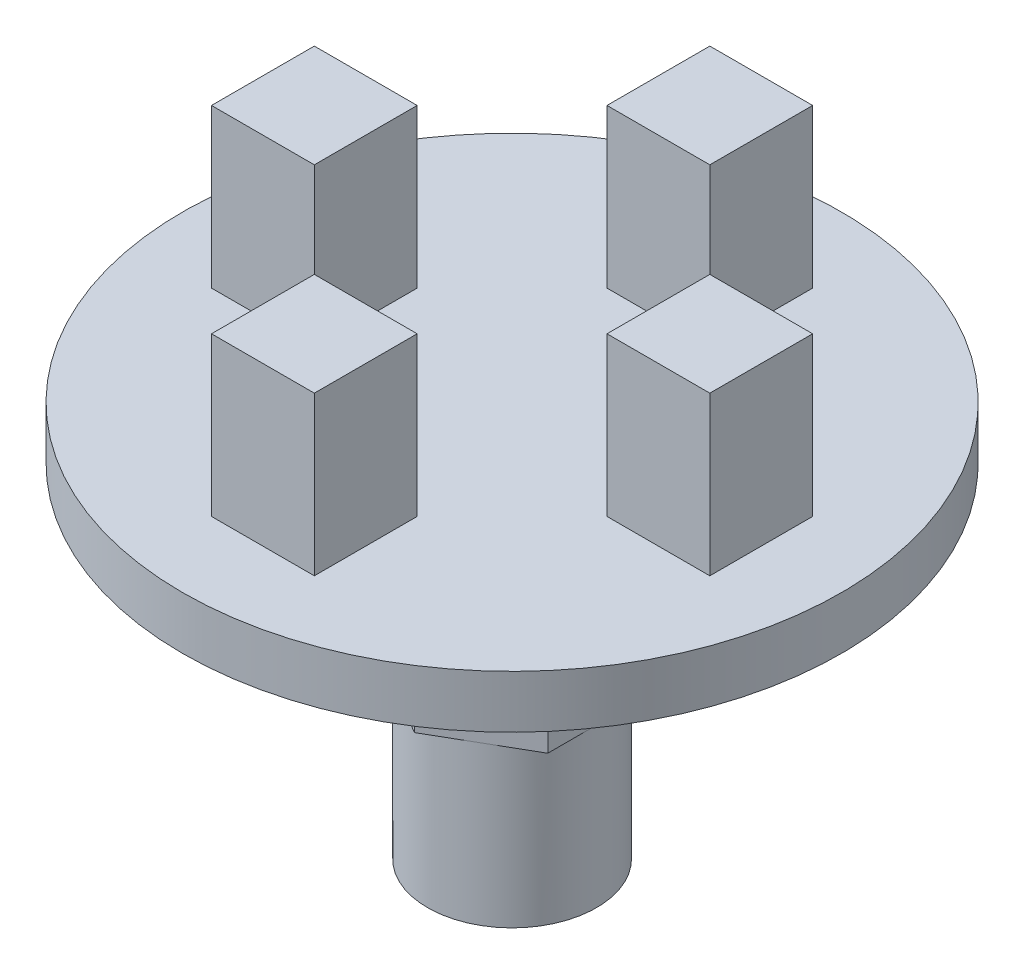
ISO-10303-21;
HEADER;
FILE_DESCRIPTION(('STEP AP214'),'2;1');
FILE_NAME('part.step','',(''),(''),'','','');
FILE_SCHEMA(('AUTOMOTIVE_DESIGN { 1 0 10303 214 1 1 1 1 }'));
ENDSEC;
DATA;
#1=APPLICATION_CONTEXT('core data for automotive mechanical design processes');
#2=APPLICATION_PROTOCOL_DEFINITION('international standard','automotive_design',2000,#1);
#3=PRODUCT_CONTEXT('',#1,'mechanical');
#4=PRODUCT('Part','Part','',(#3));
#5=PRODUCT_RELATED_PRODUCT_CATEGORY('part','',(#4));
#6=PRODUCT_DEFINITION_FORMATION('','',#4);
#7=PRODUCT_DEFINITION_CONTEXT('part definition',#1,'design');
#8=PRODUCT_DEFINITION('design','',#6,#7);
#9=PRODUCT_DEFINITION_SHAPE('','',#8);
#10=(LENGTH_UNIT() NAMED_UNIT(*) SI_UNIT(.MILLI.,.METRE.));
#11=(NAMED_UNIT(*) PLANE_ANGLE_UNIT() SI_UNIT($,.RADIAN.));
#12=(NAMED_UNIT(*) SI_UNIT($,.STERADIAN.) SOLID_ANGLE_UNIT());
#13=UNCERTAINTY_MEASURE_WITH_UNIT(LENGTH_MEASURE(1.E-05),#10,'distance_accuracy_value','');
#14=(GEOMETRIC_REPRESENTATION_CONTEXT(3) GLOBAL_UNCERTAINTY_ASSIGNED_CONTEXT((#13)) GLOBAL_UNIT_ASSIGNED_CONTEXT((#10,
#11,#12)) REPRESENTATION_CONTEXT('',''));
#15=CARTESIAN_POINT('',(0.,0.,0.));
#16=DIRECTION('',(0.,0.,1.));
#17=DIRECTION('',(1.,0.,0.));
#18=AXIS2_PLACEMENT_3D('',#15,#16,#17);
#19=CARTESIAN_POINT('',(0.,-8.,0.));
#20=DIRECTION('',(0.,-1.,0.));
#21=DIRECTION('',(0.,0.,-1.));
#22=AXIS2_PLACEMENT_3D('',#19,#20,#21);
#23=PLANE('',#22);
#24=CARTESIAN_POINT('',(0.,-8.,0.));
#25=DIRECTION('',(0.,-1.,0.));
#26=DIRECTION('',(0.,0.,-1.));
#27=AXIS2_PLACEMENT_3D('',#24,#25,#26);
#28=CIRCLE('',#27,3.20429399400242);
#29=CARTESIAN_POINT('',(1.60214699700121,-8.,-2.775));
#30=VERTEX_POINT('',#29);
#31=CARTESIAN_POINT('',(3.20429399400242,-8.,0.));
#32=VERTEX_POINT('',#31);
#33=EDGE_CURVE('E51',#30,#32,#28,.T.);
#34=ORIENTED_EDGE('',*,*,#33,.F.);
#35=DIRECTION('',(0.866025403784439,0.,0.5));
#36=VECTOR('',#35,1.);
#37=CARTESIAN_POINT('',(0.,-8.,-3.7));
#38=LINE('',#37,#36);
#39=CARTESIAN_POINT('',(3.20429399400242,-8.,-1.85));
#40=VERTEX_POINT('',#39);
#41=EDGE_CURVE('E223',#30,#40,#38,.T.);
#42=ORIENTED_EDGE('',*,*,#41,.T.);
#43=DIRECTION('',(0.,0.,1.));
#44=VECTOR('',#43,1.);
#45=CARTESIAN_POINT('',(3.20429399400242,-8.,-1.85));
#46=LINE('',#45,#44);
#47=EDGE_CURVE('E237',#40,#32,#46,.T.);
#48=ORIENTED_EDGE('',*,*,#47,.T.);
#49=EDGE_LOOP('',(#34,#42,#48));
#50=FACE_BOUND('',#49,.T.);
#51=ADVANCED_FACE('F39',(#50),#23,.T.);
#52=CARTESIAN_POINT('',(1.60214699700121,-8.,2.775));
#53=VERTEX_POINT('',#52);
#54=EDGE_CURVE('E11',#32,#53,#28,.T.);
#55=ORIENTED_EDGE('',*,*,#54,.F.);
#56=CARTESIAN_POINT('',(3.20429399400242,-8.,1.85));
#57=VERTEX_POINT('',#56);
#58=EDGE_CURVE('E222',#32,#57,#46,.T.);
#59=ORIENTED_EDGE('',*,*,#58,.T.);
#60=DIRECTION('',(-0.866025403784439,0.,0.5));
#61=VECTOR('',#60,1.);
#62=CARTESIAN_POINT('',(3.20429399400242,-8.,1.85));
#63=LINE('',#62,#61);
#64=EDGE_CURVE('E256',#57,#53,#63,.T.);
#65=ORIENTED_EDGE('',*,*,#64,.T.);
#66=EDGE_LOOP('',(#55,#59,#65));
#67=FACE_BOUND('',#66,.T.);
#68=ADVANCED_FACE('F505',(#67),#23,.T.);
#69=CARTESIAN_POINT('',(-1.60214699700121,-8.,2.775));
#70=VERTEX_POINT('',#69);
#71=EDGE_CURVE('E49',#53,#70,#28,.T.);
#72=ORIENTED_EDGE('',*,*,#71,.F.);
#73=CARTESIAN_POINT('',(0.,-8.,3.7));
#74=VERTEX_POINT('',#73);
#75=EDGE_CURVE('E255',#53,#74,#63,.T.);
#76=ORIENTED_EDGE('',*,*,#75,.T.);
#77=DIRECTION('',(-0.866025403784439,0.,-0.5));
#78=VECTOR('',#77,1.);
#79=CARTESIAN_POINT('',(0.,-8.,3.7));
#80=LINE('',#79,#78);
#81=EDGE_CURVE('E261',#74,#70,#80,.T.);
#82=ORIENTED_EDGE('',*,*,#81,.T.);
#83=EDGE_LOOP('',(#72,#76,#82));
#84=FACE_BOUND('',#83,.T.);
#85=ADVANCED_FACE('F510',(#84),#23,.T.);
#86=CARTESIAN_POINT('',(-3.20429399400242,-8.,0.));
#87=VERTEX_POINT('',#86);
#88=EDGE_CURVE('E66',#70,#87,#28,.T.);
#89=ORIENTED_EDGE('',*,*,#88,.F.);
#90=CARTESIAN_POINT('',(-3.20429399400242,-8.,1.85));
#91=VERTEX_POINT('',#90);
#92=EDGE_CURVE('E260',#70,#91,#80,.T.);
#93=ORIENTED_EDGE('',*,*,#92,.T.);
#94=DIRECTION('',(0.,0.,-1.));
#95=VECTOR('',#94,1.);
#96=CARTESIAN_POINT('',(-3.20429399400242,-8.,1.85));
#97=LINE('',#96,#95);
#98=EDGE_CURVE('E266',#91,#87,#97,.T.);
#99=ORIENTED_EDGE('',*,*,#98,.T.);
#100=EDGE_LOOP('',(#89,#93,#99));
#101=FACE_BOUND('',#100,.T.);
#102=ADVANCED_FACE('F526',(#101),#23,.T.);
#103=CARTESIAN_POINT('',(-1.60214699700121,-8.,-2.775));
#104=VERTEX_POINT('',#103);
#105=EDGE_CURVE('E58',#87,#104,#28,.T.);
#106=ORIENTED_EDGE('',*,*,#105,.F.);
#107=CARTESIAN_POINT('',(-3.20429399400242,-8.,-1.85));
#108=VERTEX_POINT('',#107);
#109=EDGE_CURVE('E265',#87,#108,#97,.T.);
#110=ORIENTED_EDGE('',*,*,#109,.T.);
#111=DIRECTION('',(0.866025403784439,0.,-0.5));
#112=VECTOR('',#111,1.);
#113=CARTESIAN_POINT('',(-3.20429399400242,-8.,-1.85));
#114=LINE('',#113,#112);
#115=EDGE_CURVE('E235',#108,#104,#114,.T.);
#116=ORIENTED_EDGE('',*,*,#115,.T.);
#117=EDGE_LOOP('',(#106,#110,#116));
#118=FACE_BOUND('',#117,.T.);
#119=ADVANCED_FACE('F516',(#118),#23,.T.);
#120=CARTESIAN_POINT('',(0.,1.,0.));
#121=DIRECTION('',(0.,1.,0.));
#122=DIRECTION('',(0.,0.,1.));
#123=AXIS2_PLACEMENT_3D('',#120,#121,#122);
#124=PLANE('',#123);
#125=CARTESIAN_POINT('',(0.,1.,0.));
#126=DIRECTION('',(0.,1.,0.));
#127=DIRECTION('',(0.,0.,1.));
#128=AXIS2_PLACEMENT_3D('',#125,#126,#127);
#129=CIRCLE('',#128,12.5);
#130=CARTESIAN_POINT('',(0.,1.,12.5));
#131=VERTEX_POINT('',#130);
#132=EDGE_CURVE('E247',#131,#131,#129,.T.);
#133=ORIENTED_EDGE('',*,*,#132,.T.);
#134=EDGE_LOOP('',(#133));
#135=FACE_BOUND('',#134,.T.);
#136=DIRECTION('',(0.,0.,1.));
#137=VECTOR('',#136,1.);
#138=CARTESIAN_POINT('',(-1.95,1.,-9.45));
#139=LINE('',#138,#137);
#140=CARTESIAN_POINT('',(-1.95,1.,-9.45));
#141=VERTEX_POINT('',#140);
#142=CARTESIAN_POINT('',(-1.95,1.,-5.55));
#143=VERTEX_POINT('',#142);
#144=EDGE_CURVE('E459',#141,#143,#139,.T.);
#145=ORIENTED_EDGE('',*,*,#144,.F.);
#146=DIRECTION('',(-1.,0.,0.));
#147=VECTOR('',#146,1.);
#148=CARTESIAN_POINT('',(-1.95,1.,-9.45));
#149=LINE('',#148,#147);
#150=CARTESIAN_POINT('',(1.95,1.,-9.45));
#151=VERTEX_POINT('',#150);
#152=EDGE_CURVE('E440',#151,#141,#149,.T.);
#153=ORIENTED_EDGE('',*,*,#152,.F.);
#154=DIRECTION('',(0.,0.,-1.));
#155=VECTOR('',#154,1.);
#156=CARTESIAN_POINT('',(1.95,1.,-9.45));
#157=LINE('',#156,#155);
#158=CARTESIAN_POINT('',(1.95,1.,-5.55));
#159=VERTEX_POINT('',#158);
#160=EDGE_CURVE('E446',#159,#151,#157,.T.);
#161=ORIENTED_EDGE('',*,*,#160,.F.);
#162=DIRECTION('',(1.,0.,0.));
#163=VECTOR('',#162,1.);
#164=CARTESIAN_POINT('',(-1.95,1.,-5.55));
#165=LINE('',#164,#163);
#166=EDGE_CURVE('E462',#143,#159,#165,.T.);
#167=ORIENTED_EDGE('',*,*,#166,.F.);
#168=EDGE_LOOP('',(#145,#153,#161,#167));
#169=FACE_BOUND('',#168,.T.);
#170=DIRECTION('',(-1.,0.,0.));
#171=VECTOR('',#170,1.);
#172=CARTESIAN_POINT('',(9.45000000000043,1.,-1.95000000000085));
#173=LINE('',#172,#171);
#174=CARTESIAN_POINT('',(9.45000000000043,1.,-1.95000000000085));
#175=VERTEX_POINT('',#174);
#176=CARTESIAN_POINT('',(5.55000000000043,1.,-1.95000000000085));
#177=VERTEX_POINT('',#176);
#178=EDGE_CURVE('E418',#175,#177,#173,.T.);
#179=ORIENTED_EDGE('',*,*,#178,.F.);
#180=DIRECTION('',(0.,0.,-1.));
#181=VECTOR('',#180,1.);
#182=CARTESIAN_POINT('',(9.45000000000043,1.,-1.95000000000085));
#183=LINE('',#182,#181);
#184=CARTESIAN_POINT('',(9.45000000000043,1.,1.94999999999915));
#185=VERTEX_POINT('',#184);
#186=EDGE_CURVE('E399',#185,#175,#183,.T.);
#187=ORIENTED_EDGE('',*,*,#186,.F.);
#188=DIRECTION('',(1.,0.,0.));
#189=VECTOR('',#188,1.);
#190=CARTESIAN_POINT('',(9.45000000000043,1.,1.94999999999915));
#191=LINE('',#190,#189);
#192=CARTESIAN_POINT('',(5.55000000000043,1.,1.94999999999915));
#193=VERTEX_POINT('',#192);
#194=EDGE_CURVE('E405',#193,#185,#191,.T.);
#195=ORIENTED_EDGE('',*,*,#194,.F.);
#196=DIRECTION('',(0.,0.,1.));
#197=VECTOR('',#196,1.);
#198=CARTESIAN_POINT('',(5.55000000000043,1.,-1.95000000000085));
#199=LINE('',#198,#197);
#200=EDGE_CURVE('E421',#177,#193,#199,.T.);
#201=ORIENTED_EDGE('',*,*,#200,.F.);
#202=EDGE_LOOP('',(#179,#187,#195,#201));
#203=FACE_BOUND('',#202,.T.);
#204=DIRECTION('',(0.,0.,-1.));
#205=VECTOR('',#204,1.);
#206=CARTESIAN_POINT('',(1.95000000000128,1.,9.44999999999958));
#207=LINE('',#206,#205);
#208=CARTESIAN_POINT('',(1.95000000000128,1.,9.44999999999958));
#209=VERTEX_POINT('',#208);
#210=CARTESIAN_POINT('',(1.95000000000128,1.,5.54999999999958));
#211=VERTEX_POINT('',#210);
#212=EDGE_CURVE('E377',#209,#211,#207,.T.);
#213=ORIENTED_EDGE('',*,*,#212,.F.);
#214=DIRECTION('',(1.,0.,0.));
#215=VECTOR('',#214,1.);
#216=CARTESIAN_POINT('',(1.95000000000128,1.,9.44999999999958));
#217=LINE('',#216,#215);
#218=CARTESIAN_POINT('',(-1.94999999999872,1.,9.44999999999958));
#219=VERTEX_POINT('',#218);
#220=EDGE_CURVE('E358',#219,#209,#217,.T.);
#221=ORIENTED_EDGE('',*,*,#220,.F.);
#222=DIRECTION('',(0.,0.,1.));
#223=VECTOR('',#222,1.);
#224=CARTESIAN_POINT('',(-1.94999999999872,1.,9.44999999999958));
#225=LINE('',#224,#223);
#226=CARTESIAN_POINT('',(-1.94999999999872,1.,5.54999999999958));
#227=VERTEX_POINT('',#226);
#228=EDGE_CURVE('E364',#227,#219,#225,.T.);
#229=ORIENTED_EDGE('',*,*,#228,.F.);
#230=DIRECTION('',(-1.,0.,0.));
#231=VECTOR('',#230,1.);
#232=CARTESIAN_POINT('',(1.95000000000128,1.,5.54999999999958));
#233=LINE('',#232,#231);
#234=EDGE_CURVE('E380',#211,#227,#233,.T.);
#235=ORIENTED_EDGE('',*,*,#234,.F.);
#236=EDGE_LOOP('',(#213,#221,#229,#235));
#237=FACE_BOUND('',#236,.T.);
#238=DIRECTION('',(1.,0.,0.));
#239=VECTOR('',#238,1.);
#240=CARTESIAN_POINT('',(-9.44999999999915,1.,1.95000000000043));
#241=LINE('',#240,#239);
#242=CARTESIAN_POINT('',(-9.44999999999915,1.,1.95000000000043));
#243=VERTEX_POINT('',#242);
#244=CARTESIAN_POINT('',(-5.54999999999915,1.,1.95000000000043));
#245=VERTEX_POINT('',#244);
#246=EDGE_CURVE('E336',#243,#245,#241,.T.);
#247=ORIENTED_EDGE('',*,*,#246,.F.);
#248=DIRECTION('',(0.,0.,1.));
#249=VECTOR('',#248,1.);
#250=CARTESIAN_POINT('',(-9.44999999999915,1.,1.95000000000043));
#251=LINE('',#250,#249);
#252=CARTESIAN_POINT('',(-9.44999999999915,1.,-1.94999999999957));
#253=VERTEX_POINT('',#252);
#254=EDGE_CURVE('E316',#253,#243,#251,.T.);
#255=ORIENTED_EDGE('',*,*,#254,.F.);
#256=DIRECTION('',(-1.,0.,0.));
#257=VECTOR('',#256,1.);
#258=CARTESIAN_POINT('',(-9.44999999999915,1.,-1.94999999999957));
#259=LINE('',#258,#257);
#260=CARTESIAN_POINT('',(-5.54999999999915,1.,-1.94999999999957));
#261=VERTEX_POINT('',#260);
#262=EDGE_CURVE('E323',#261,#253,#259,.T.);
#263=ORIENTED_EDGE('',*,*,#262,.F.);
#264=DIRECTION('',(0.,0.,-1.));
#265=VECTOR('',#264,1.);
#266=CARTESIAN_POINT('',(-5.54999999999915,1.,1.95000000000043));
#267=LINE('',#266,#265);
#268=EDGE_CURVE('E339',#245,#261,#267,.T.);
#269=ORIENTED_EDGE('',*,*,#268,.F.);
#270=EDGE_LOOP('',(#247,#255,#263,#269));
#271=FACE_BOUND('',#270,.T.);
#272=ADVANCED_FACE('F500',(#135,#169,#203,#237,#271),#124,.T.);
#273=CARTESIAN_POINT('',(0.,1.,0.));
#274=DIRECTION('',(0.,-1.,0.));
#275=DIRECTION('',(0.,0.,-1.));
#276=AXIS2_PLACEMENT_3D('',#273,#274,#275);
#277=CYLINDRICAL_SURFACE('',#276,12.5);
#278=ORIENTED_EDGE('',*,*,#132,.F.);
#279=EDGE_LOOP('',(#278));
#280=FACE_BOUND('',#279,.T.);
#281=CARTESIAN_POINT('',(0.,-1.,0.));
#282=DIRECTION('',(0.,1.,0.));
#283=DIRECTION('',(0.,0.,1.));
#284=AXIS2_PLACEMENT_3D('',#281,#282,#283);
#285=CIRCLE('',#284,12.5);
#286=CARTESIAN_POINT('',(0.,-1.,12.5));
#287=VERTEX_POINT('',#286);
#288=EDGE_CURVE('E43',#287,#287,#285,.T.);
#289=ORIENTED_EDGE('',*,*,#288,.T.);
#290=EDGE_LOOP('',(#289));
#291=FACE_BOUND('',#290,.T.);
#292=ADVANCED_FACE('F41',(#280,#291),#277,.T.);
#293=CARTESIAN_POINT('',(0.,-1.,0.));
#294=DIRECTION('',(0.,1.,0.));
#295=DIRECTION('',(0.,0.,1.));
#296=AXIS2_PLACEMENT_3D('',#293,#294,#295);
#297=PLANE('',#296);
#298=CARTESIAN_POINT('',(0.,-1.,0.));
#299=DIRECTION('',(0.,-1.,0.));
#300=DIRECTION('',(0.,0.,-1.));
#301=AXIS2_PLACEMENT_3D('',#298,#299,#300);
#302=CIRCLE('',#301,5.);
#303=CARTESIAN_POINT('',(0.,-1.,-5.));
#304=VERTEX_POINT('',#303);
#305=EDGE_CURVE('E243',#304,#304,#302,.T.);
#306=ORIENTED_EDGE('',*,*,#305,.F.);
#307=EDGE_LOOP('',(#306));
#308=FACE_BOUND('',#307,.T.);
#309=ORIENTED_EDGE('',*,*,#288,.F.);
#310=EDGE_LOOP('',(#309));
#311=FACE_BOUND('',#310,.T.);
#312=ADVANCED_FACE('F489',(#308,#311),#297,.F.);
#313=CARTESIAN_POINT('',(-1.95,7.,-9.45));
#314=DIRECTION('',(0.,0.,1.));
#315=DIRECTION('',(1.,0.,0.));
#316=AXIS2_PLACEMENT_3D('',#313,#314,#315);
#317=PLANE('',#316);
#318=ORIENTED_EDGE('',*,*,#152,.T.);
#319=DIRECTION('',(0.,-1.,0.));
#320=VECTOR('',#319,1.);
#321=CARTESIAN_POINT('',(-1.95,7.,-9.45));
#322=LINE('',#321,#320);
#323=CARTESIAN_POINT('',(-1.95,7.,-9.45));
#324=VERTEX_POINT('',#323);
#325=EDGE_CURVE('E478',#324,#141,#322,.T.);
#326=ORIENTED_EDGE('',*,*,#325,.F.);
#327=DIRECTION('',(-1.,0.,0.));
#328=VECTOR('',#327,1.);
#329=CARTESIAN_POINT('',(-1.95,7.,-9.45));
#330=LINE('',#329,#328);
#331=CARTESIAN_POINT('',(1.95,7.,-9.45));
#332=VERTEX_POINT('',#331);
#333=EDGE_CURVE('E441',#332,#324,#330,.T.);
#334=ORIENTED_EDGE('',*,*,#333,.F.);
#335=DIRECTION('',(0.,-1.,0.));
#336=VECTOR('',#335,1.);
#337=CARTESIAN_POINT('',(1.95,7.,-9.45));
#338=LINE('',#337,#336);
#339=EDGE_CURVE('E455',#332,#151,#338,.T.);
#340=ORIENTED_EDGE('',*,*,#339,.T.);
#341=EDGE_LOOP('',(#318,#326,#334,#340));
#342=FACE_BOUND('',#341,.T.);
#343=ADVANCED_FACE('F491',(#342),#317,.F.);
#344=CARTESIAN_POINT('',(-1.95,7.,-9.45));
#345=DIRECTION('',(1.,0.,0.));
#346=DIRECTION('',(0.,0.,-1.));
#347=AXIS2_PLACEMENT_3D('',#344,#345,#346);
#348=PLANE('',#347);
#349=ORIENTED_EDGE('',*,*,#144,.T.);
#350=DIRECTION('',(0.,-1.,0.));
#351=VECTOR('',#350,1.);
#352=CARTESIAN_POINT('',(-1.95,7.,-5.55));
#353=LINE('',#352,#351);
#354=CARTESIAN_POINT('',(-1.95,7.,-5.55));
#355=VERTEX_POINT('',#354);
#356=EDGE_CURVE('E474',#355,#143,#353,.T.);
#357=ORIENTED_EDGE('',*,*,#356,.F.);
#358=DIRECTION('',(0.,0.,1.));
#359=VECTOR('',#358,1.);
#360=CARTESIAN_POINT('',(-1.95,7.,-9.45));
#361=LINE('',#360,#359);
#362=EDGE_CURVE('E445',#324,#355,#361,.T.);
#363=ORIENTED_EDGE('',*,*,#362,.F.);
#364=ORIENTED_EDGE('',*,*,#325,.T.);
#365=EDGE_LOOP('',(#349,#357,#363,#364));
#366=FACE_BOUND('',#365,.T.);
#367=ADVANCED_FACE('F497',(#366),#348,.F.);
#368=CARTESIAN_POINT('',(-1.95,7.,-5.55));
#369=DIRECTION('',(0.,0.,-1.));
#370=DIRECTION('',(-1.,0.,0.));
#371=AXIS2_PLACEMENT_3D('',#368,#369,#370);
#372=PLANE('',#371);
#373=ORIENTED_EDGE('',*,*,#166,.T.);
#374=DIRECTION('',(0.,-1.,0.));
#375=VECTOR('',#374,1.);
#376=CARTESIAN_POINT('',(1.95,7.,-5.55));
#377=LINE('',#376,#375);
#378=CARTESIAN_POINT('',(1.95,7.,-5.55));
#379=VERTEX_POINT('',#378);
#380=EDGE_CURVE('E471',#379,#159,#377,.T.);
#381=ORIENTED_EDGE('',*,*,#380,.F.);
#382=DIRECTION('',(1.,0.,0.));
#383=VECTOR('',#382,1.);
#384=CARTESIAN_POINT('',(-1.95,7.,-5.55));
#385=LINE('',#384,#383);
#386=EDGE_CURVE('E449',#355,#379,#385,.T.);
#387=ORIENTED_EDGE('',*,*,#386,.F.);
#388=ORIENTED_EDGE('',*,*,#356,.T.);
#389=EDGE_LOOP('',(#373,#381,#387,#388));
#390=FACE_BOUND('',#389,.T.);
#391=ADVANCED_FACE('F839',(#390),#372,.F.);
#392=CARTESIAN_POINT('',(1.95,7.,-9.45));
#393=DIRECTION('',(-1.,0.,0.));
#394=DIRECTION('',(0.,0.,1.));
#395=AXIS2_PLACEMENT_3D('',#392,#393,#394);
#396=PLANE('',#395);
#397=ORIENTED_EDGE('',*,*,#160,.T.);
#398=ORIENTED_EDGE('',*,*,#339,.F.);
#399=DIRECTION('',(0.,0.,-1.));
#400=VECTOR('',#399,1.);
#401=CARTESIAN_POINT('',(1.95,7.,-9.45));
#402=LINE('',#401,#400);
#403=EDGE_CURVE('E452',#379,#332,#402,.T.);
#404=ORIENTED_EDGE('',*,*,#403,.F.);
#405=ORIENTED_EDGE('',*,*,#380,.T.);
#406=EDGE_LOOP('',(#397,#398,#404,#405));
#407=FACE_BOUND('',#406,.T.);
#408=ADVANCED_FACE('F829',(#407),#396,.F.);
#409=CARTESIAN_POINT('',(0.,7.,0.));
#410=DIRECTION('',(0.,-1.,0.));
#411=DIRECTION('',(0.,0.,-1.));
#412=AXIS2_PLACEMENT_3D('',#409,#410,#411);
#413=PLANE('',#412);
#414=ORIENTED_EDGE('',*,*,#333,.T.);
#415=ORIENTED_EDGE('',*,*,#362,.T.);
#416=ORIENTED_EDGE('',*,*,#386,.T.);
#417=ORIENTED_EDGE('',*,*,#403,.T.);
#418=EDGE_LOOP('',(#414,#415,#416,#417));
#419=FACE_BOUND('',#418,.T.);
#420=ADVANCED_FACE('F819',(#419),#413,.F.);
#421=CARTESIAN_POINT('',(9.45000000000043,7.,-1.95000000000085));
#422=DIRECTION('',(-1.,0.,0.));
#423=DIRECTION('',(0.,0.,1.));
#424=AXIS2_PLACEMENT_3D('',#421,#422,#423);
#425=PLANE('',#424);
#426=ORIENTED_EDGE('',*,*,#186,.T.);
#427=DIRECTION('',(0.,-1.,0.));
#428=VECTOR('',#427,1.);
#429=CARTESIAN_POINT('',(9.45000000000043,7.,-1.95000000000085));
#430=LINE('',#429,#428);
#431=CARTESIAN_POINT('',(9.45000000000043,7.,-1.95000000000085));
#432=VERTEX_POINT('',#431);
#433=EDGE_CURVE('E437',#432,#175,#430,.T.);
#434=ORIENTED_EDGE('',*,*,#433,.F.);
#435=DIRECTION('',(0.,0.,-1.));
#436=VECTOR('',#435,1.);
#437=CARTESIAN_POINT('',(9.45000000000043,7.,-1.95000000000085));
#438=LINE('',#437,#436);
#439=CARTESIAN_POINT('',(9.45000000000043,7.,1.94999999999915));
#440=VERTEX_POINT('',#439);
#441=EDGE_CURVE('E400',#440,#432,#438,.T.);
#442=ORIENTED_EDGE('',*,*,#441,.F.);
#443=DIRECTION('',(0.,-1.,0.));
#444=VECTOR('',#443,1.);
#445=CARTESIAN_POINT('',(9.45000000000043,7.,1.94999999999915));
#446=LINE('',#445,#444);
#447=EDGE_CURVE('E414',#440,#185,#446,.T.);
#448=ORIENTED_EDGE('',*,*,#447,.T.);
#449=EDGE_LOOP('',(#426,#434,#442,#448));
#450=FACE_BOUND('',#449,.T.);
#451=ADVANCED_FACE('F809',(#450),#425,.F.);
#452=CARTESIAN_POINT('',(9.45000000000043,7.,-1.95000000000085));
#453=DIRECTION('',(0.,0.,1.));
#454=DIRECTION('',(1.,0.,0.));
#455=AXIS2_PLACEMENT_3D('',#452,#453,#454);
#456=PLANE('',#455);
#457=ORIENTED_EDGE('',*,*,#178,.T.);
#458=DIRECTION('',(0.,-1.,0.));
#459=VECTOR('',#458,1.);
#460=CARTESIAN_POINT('',(5.55000000000043,7.,-1.95000000000085));
#461=LINE('',#460,#459);
#462=CARTESIAN_POINT('',(5.55000000000043,7.,-1.95000000000085));
#463=VERTEX_POINT('',#462);
#464=EDGE_CURVE('E433',#463,#177,#461,.T.);
#465=ORIENTED_EDGE('',*,*,#464,.F.);
#466=DIRECTION('',(-1.,0.,0.));
#467=VECTOR('',#466,1.);
#468=CARTESIAN_POINT('',(9.45000000000043,7.,-1.95000000000085));
#469=LINE('',#468,#467);
#470=EDGE_CURVE('E404',#432,#463,#469,.T.);
#471=ORIENTED_EDGE('',*,*,#470,.F.);
#472=ORIENTED_EDGE('',*,*,#433,.T.);
#473=EDGE_LOOP('',(#457,#465,#471,#472));
#474=FACE_BOUND('',#473,.T.);
#475=ADVANCED_FACE('F799',(#474),#456,.F.);
#476=CARTESIAN_POINT('',(5.55000000000043,7.,-1.95000000000085));
#477=DIRECTION('',(1.,0.,0.));
#478=DIRECTION('',(0.,0.,-1.));
#479=AXIS2_PLACEMENT_3D('',#476,#477,#478);
#480=PLANE('',#479);
#481=ORIENTED_EDGE('',*,*,#200,.T.);
#482=DIRECTION('',(0.,-1.,0.));
#483=VECTOR('',#482,1.);
#484=CARTESIAN_POINT('',(5.55000000000043,7.,1.94999999999915));
#485=LINE('',#484,#483);
#486=CARTESIAN_POINT('',(5.55000000000043,7.,1.94999999999915));
#487=VERTEX_POINT('',#486);
#488=EDGE_CURVE('E430',#487,#193,#485,.T.);
#489=ORIENTED_EDGE('',*,*,#488,.F.);
#490=DIRECTION('',(0.,0.,1.));
#491=VECTOR('',#490,1.);
#492=CARTESIAN_POINT('',(5.55000000000043,7.,-1.95000000000085));
#493=LINE('',#492,#491);
#494=EDGE_CURVE('E408',#463,#487,#493,.T.);
#495=ORIENTED_EDGE('',*,*,#494,.F.);
#496=ORIENTED_EDGE('',*,*,#464,.T.);
#497=EDGE_LOOP('',(#481,#489,#495,#496));
#498=FACE_BOUND('',#497,.T.);
#499=ADVANCED_FACE('F789',(#498),#480,.F.);
#500=CARTESIAN_POINT('',(9.45000000000043,7.,1.94999999999915));
#501=DIRECTION('',(0.,0.,-1.));
#502=DIRECTION('',(-1.,0.,0.));
#503=AXIS2_PLACEMENT_3D('',#500,#501,#502);
#504=PLANE('',#503);
#505=ORIENTED_EDGE('',*,*,#194,.T.);
#506=ORIENTED_EDGE('',*,*,#447,.F.);
#507=DIRECTION('',(1.,0.,0.));
#508=VECTOR('',#507,1.);
#509=CARTESIAN_POINT('',(9.45000000000043,7.,1.94999999999915));
#510=LINE('',#509,#508);
#511=EDGE_CURVE('E411',#487,#440,#510,.T.);
#512=ORIENTED_EDGE('',*,*,#511,.F.);
#513=ORIENTED_EDGE('',*,*,#488,.T.);
#514=EDGE_LOOP('',(#505,#506,#512,#513));
#515=FACE_BOUND('',#514,.T.);
#516=ADVANCED_FACE('F779',(#515),#504,.F.);
#517=CARTESIAN_POINT('',(0.,7.,0.));
#518=DIRECTION('',(0.,-1.,0.));
#519=DIRECTION('',(0.,0.,-1.));
#520=AXIS2_PLACEMENT_3D('',#517,#518,#519);
#521=PLANE('',#520);
#522=ORIENTED_EDGE('',*,*,#441,.T.);
#523=ORIENTED_EDGE('',*,*,#470,.T.);
#524=ORIENTED_EDGE('',*,*,#494,.T.);
#525=ORIENTED_EDGE('',*,*,#511,.T.);
#526=EDGE_LOOP('',(#522,#523,#524,#525));
#527=FACE_BOUND('',#526,.T.);
#528=ADVANCED_FACE('F769',(#527),#521,.F.);
#529=CARTESIAN_POINT('',(1.95000000000128,7.,9.44999999999958));
#530=DIRECTION('',(0.,0.,-1.));
#531=DIRECTION('',(-1.,0.,0.));
#532=AXIS2_PLACEMENT_3D('',#529,#530,#531);
#533=PLANE('',#532);
#534=ORIENTED_EDGE('',*,*,#220,.T.);
#535=DIRECTION('',(0.,-1.,0.));
#536=VECTOR('',#535,1.);
#537=CARTESIAN_POINT('',(1.95000000000128,7.,9.44999999999958));
#538=LINE('',#537,#536);
#539=CARTESIAN_POINT('',(1.95000000000128,7.,9.44999999999958));
#540=VERTEX_POINT('',#539);
#541=EDGE_CURVE('E396',#540,#209,#538,.T.);
#542=ORIENTED_EDGE('',*,*,#541,.F.);
#543=DIRECTION('',(1.,0.,0.));
#544=VECTOR('',#543,1.);
#545=CARTESIAN_POINT('',(1.95000000000128,7.,9.44999999999958));
#546=LINE('',#545,#544);
#547=CARTESIAN_POINT('',(-1.94999999999872,7.,9.44999999999958));
#548=VERTEX_POINT('',#547);
#549=EDGE_CURVE('E359',#548,#540,#546,.T.);
#550=ORIENTED_EDGE('',*,*,#549,.F.);
#551=DIRECTION('',(0.,-1.,0.));
#552=VECTOR('',#551,1.);
#553=CARTESIAN_POINT('',(-1.94999999999872,7.,9.44999999999958));
#554=LINE('',#553,#552);
#555=EDGE_CURVE('E373',#548,#219,#554,.T.);
#556=ORIENTED_EDGE('',*,*,#555,.T.);
#557=EDGE_LOOP('',(#534,#542,#550,#556));
#558=FACE_BOUND('',#557,.T.);
#559=ADVANCED_FACE('F759',(#558),#533,.F.);
#560=CARTESIAN_POINT('',(1.95000000000128,7.,9.44999999999958));
#561=DIRECTION('',(-1.,0.,0.));
#562=DIRECTION('',(0.,0.,1.));
#563=AXIS2_PLACEMENT_3D('',#560,#561,#562);
#564=PLANE('',#563);
#565=ORIENTED_EDGE('',*,*,#212,.T.);
#566=DIRECTION('',(0.,-1.,0.));
#567=VECTOR('',#566,1.);
#568=CARTESIAN_POINT('',(1.95000000000128,7.,5.54999999999958));
#569=LINE('',#568,#567);
#570=CARTESIAN_POINT('',(1.95000000000128,7.,5.54999999999958));
#571=VERTEX_POINT('',#570);
#572=EDGE_CURVE('E392',#571,#211,#569,.T.);
#573=ORIENTED_EDGE('',*,*,#572,.F.);
#574=DIRECTION('',(0.,0.,-1.));
#575=VECTOR('',#574,1.);
#576=CARTESIAN_POINT('',(1.95000000000128,7.,9.44999999999958));
#577=LINE('',#576,#575);
#578=EDGE_CURVE('E363',#540,#571,#577,.T.);
#579=ORIENTED_EDGE('',*,*,#578,.F.);
#580=ORIENTED_EDGE('',*,*,#541,.T.);
#581=EDGE_LOOP('',(#565,#573,#579,#580));
#582=FACE_BOUND('',#581,.T.);
#583=ADVANCED_FACE('F749',(#582),#564,.F.);
#584=CARTESIAN_POINT('',(1.95000000000128,7.,5.54999999999958));
#585=DIRECTION('',(0.,0.,1.));
#586=DIRECTION('',(1.,0.,0.));
#587=AXIS2_PLACEMENT_3D('',#584,#585,#586);
#588=PLANE('',#587);
#589=ORIENTED_EDGE('',*,*,#234,.T.);
#590=DIRECTION('',(0.,-1.,0.));
#591=VECTOR('',#590,1.);
#592=CARTESIAN_POINT('',(-1.94999999999872,7.,5.54999999999958));
#593=LINE('',#592,#591);
#594=CARTESIAN_POINT('',(-1.94999999999872,7.,5.54999999999958));
#595=VERTEX_POINT('',#594);
#596=EDGE_CURVE('E389',#595,#227,#593,.T.);
#597=ORIENTED_EDGE('',*,*,#596,.F.);
#598=DIRECTION('',(-1.,0.,0.));
#599=VECTOR('',#598,1.);
#600=CARTESIAN_POINT('',(1.95000000000128,7.,5.54999999999958));
#601=LINE('',#600,#599);
#602=EDGE_CURVE('E367',#571,#595,#601,.T.);
#603=ORIENTED_EDGE('',*,*,#602,.F.);
#604=ORIENTED_EDGE('',*,*,#572,.T.);
#605=EDGE_LOOP('',(#589,#597,#603,#604));
#606=FACE_BOUND('',#605,.T.);
#607=ADVANCED_FACE('F739',(#606),#588,.F.);
#608=CARTESIAN_POINT('',(-1.94999999999872,7.,9.44999999999958));
#609=DIRECTION('',(1.,0.,0.));
#610=DIRECTION('',(0.,0.,-1.));
#611=AXIS2_PLACEMENT_3D('',#608,#609,#610);
#612=PLANE('',#611);
#613=ORIENTED_EDGE('',*,*,#228,.T.);
#614=ORIENTED_EDGE('',*,*,#555,.F.);
#615=DIRECTION('',(0.,0.,1.));
#616=VECTOR('',#615,1.);
#617=CARTESIAN_POINT('',(-1.94999999999872,7.,9.44999999999958));
#618=LINE('',#617,#616);
#619=EDGE_CURVE('E370',#595,#548,#618,.T.);
#620=ORIENTED_EDGE('',*,*,#619,.F.);
#621=ORIENTED_EDGE('',*,*,#596,.T.);
#622=EDGE_LOOP('',(#613,#614,#620,#621));
#623=FACE_BOUND('',#622,.T.);
#624=ADVANCED_FACE('F729',(#623),#612,.F.);
#625=CARTESIAN_POINT('',(0.,7.,0.));
#626=DIRECTION('',(0.,-1.,0.));
#627=DIRECTION('',(0.,0.,-1.));
#628=AXIS2_PLACEMENT_3D('',#625,#626,#627);
#629=PLANE('',#628);
#630=ORIENTED_EDGE('',*,*,#549,.T.);
#631=ORIENTED_EDGE('',*,*,#578,.T.);
#632=ORIENTED_EDGE('',*,*,#602,.T.);
#633=ORIENTED_EDGE('',*,*,#619,.T.);
#634=EDGE_LOOP('',(#630,#631,#632,#633));
#635=FACE_BOUND('',#634,.T.);
#636=ADVANCED_FACE('F719',(#635),#629,.F.);
#637=CARTESIAN_POINT('',(-9.44999999999915,7.,1.95000000000043));
#638=DIRECTION('',(1.,0.,0.));
#639=DIRECTION('',(0.,0.,-1.));
#640=AXIS2_PLACEMENT_3D('',#637,#638,#639);
#641=PLANE('',#640);
#642=ORIENTED_EDGE('',*,*,#254,.T.);
#643=DIRECTION('',(0.,-1.,0.));
#644=VECTOR('',#643,1.);
#645=CARTESIAN_POINT('',(-9.44999999999915,7.,1.95000000000043));
#646=LINE('',#645,#644);
#647=CARTESIAN_POINT('',(-9.44999999999915,7.,1.95000000000043));
#648=VERTEX_POINT('',#647);
#649=EDGE_CURVE('E355',#648,#243,#646,.T.);
#650=ORIENTED_EDGE('',*,*,#649,.F.);
#651=DIRECTION('',(0.,0.,1.));
#652=VECTOR('',#651,1.);
#653=CARTESIAN_POINT('',(-9.44999999999915,7.,1.95000000000043));
#654=LINE('',#653,#652);
#655=CARTESIAN_POINT('',(-9.44999999999915,7.,-1.94999999999957));
#656=VERTEX_POINT('',#655);
#657=EDGE_CURVE('E318',#656,#648,#654,.T.);
#658=ORIENTED_EDGE('',*,*,#657,.F.);
#659=DIRECTION('',(0.,-1.,0.));
#660=VECTOR('',#659,1.);
#661=CARTESIAN_POINT('',(-9.44999999999915,7.,-1.94999999999957));
#662=LINE('',#661,#660);
#663=EDGE_CURVE('E332',#656,#253,#662,.T.);
#664=ORIENTED_EDGE('',*,*,#663,.T.);
#665=EDGE_LOOP('',(#642,#650,#658,#664));
#666=FACE_BOUND('',#665,.T.);
#667=ADVANCED_FACE('F709',(#666),#641,.F.);
#668=CARTESIAN_POINT('',(-9.44999999999915,7.,1.95000000000043));
#669=DIRECTION('',(0.,0.,-1.));
#670=DIRECTION('',(-1.,0.,0.));
#671=AXIS2_PLACEMENT_3D('',#668,#669,#670);
#672=PLANE('',#671);
#673=ORIENTED_EDGE('',*,*,#246,.T.);
#674=DIRECTION('',(0.,-1.,0.));
#675=VECTOR('',#674,1.);
#676=CARTESIAN_POINT('',(-5.54999999999915,7.,1.95000000000043));
#677=LINE('',#676,#675);
#678=CARTESIAN_POINT('',(-5.54999999999915,7.,1.95000000000043));
#679=VERTEX_POINT('',#678);
#680=EDGE_CURVE('E351',#679,#245,#677,.T.);
#681=ORIENTED_EDGE('',*,*,#680,.F.);
#682=DIRECTION('',(1.,0.,0.));
#683=VECTOR('',#682,1.);
#684=CARTESIAN_POINT('',(-9.44999999999915,7.,1.95000000000043));
#685=LINE('',#684,#683);
#686=EDGE_CURVE('E322',#648,#679,#685,.T.);
#687=ORIENTED_EDGE('',*,*,#686,.F.);
#688=ORIENTED_EDGE('',*,*,#649,.T.);
#689=EDGE_LOOP('',(#673,#681,#687,#688));
#690=FACE_BOUND('',#689,.T.);
#691=ADVANCED_FACE('F699',(#690),#672,.F.);
#692=CARTESIAN_POINT('',(-5.54999999999915,7.,1.95000000000043));
#693=DIRECTION('',(-1.,0.,0.));
#694=DIRECTION('',(0.,0.,1.));
#695=AXIS2_PLACEMENT_3D('',#692,#693,#694);
#696=PLANE('',#695);
#697=ORIENTED_EDGE('',*,*,#268,.T.);
#698=DIRECTION('',(0.,-1.,0.));
#699=VECTOR('',#698,1.);
#700=CARTESIAN_POINT('',(-5.54999999999915,7.,-1.94999999999957));
#701=LINE('',#700,#699);
#702=CARTESIAN_POINT('',(-5.54999999999915,7.,-1.94999999999957));
#703=VERTEX_POINT('',#702);
#704=EDGE_CURVE('E348',#703,#261,#701,.T.);
#705=ORIENTED_EDGE('',*,*,#704,.F.);
#706=DIRECTION('',(0.,0.,-1.));
#707=VECTOR('',#706,1.);
#708=CARTESIAN_POINT('',(-5.54999999999915,7.,1.95000000000043));
#709=LINE('',#708,#707);
#710=EDGE_CURVE('E326',#679,#703,#709,.T.);
#711=ORIENTED_EDGE('',*,*,#710,.F.);
#712=ORIENTED_EDGE('',*,*,#680,.T.);
#713=EDGE_LOOP('',(#697,#705,#711,#712));
#714=FACE_BOUND('',#713,.T.);
#715=ADVANCED_FACE('F689',(#714),#696,.F.);
#716=CARTESIAN_POINT('',(-9.44999999999915,7.,-1.94999999999957));
#717=DIRECTION('',(0.,0.,1.));
#718=DIRECTION('',(1.,0.,0.));
#719=AXIS2_PLACEMENT_3D('',#716,#717,#718);
#720=PLANE('',#719);
#721=ORIENTED_EDGE('',*,*,#262,.T.);
#722=ORIENTED_EDGE('',*,*,#663,.F.);
#723=DIRECTION('',(-1.,0.,0.));
#724=VECTOR('',#723,1.);
#725=CARTESIAN_POINT('',(-9.44999999999915,7.,-1.94999999999957));
#726=LINE('',#725,#724);
#727=EDGE_CURVE('E329',#703,#656,#726,.T.);
#728=ORIENTED_EDGE('',*,*,#727,.F.);
#729=ORIENTED_EDGE('',*,*,#704,.T.);
#730=EDGE_LOOP('',(#721,#722,#728,#729));
#731=FACE_BOUND('',#730,.T.);
#732=ADVANCED_FACE('F679',(#731),#720,.F.);
#733=CARTESIAN_POINT('',(0.,7.,0.));
#734=DIRECTION('',(0.,-1.,0.));
#735=DIRECTION('',(0.,0.,-1.));
#736=AXIS2_PLACEMENT_3D('',#733,#734,#735);
#737=PLANE('',#736);
#738=ORIENTED_EDGE('',*,*,#657,.T.);
#739=ORIENTED_EDGE('',*,*,#686,.T.);
#740=ORIENTED_EDGE('',*,*,#710,.T.);
#741=ORIENTED_EDGE('',*,*,#727,.T.);
#742=EDGE_LOOP('',(#738,#739,#740,#741));
#743=FACE_BOUND('',#742,.T.);
#744=ADVANCED_FACE('F662',(#743),#737,.F.);
#745=CARTESIAN_POINT('',(0.,-2.,0.));
#746=DIRECTION('',(0.,1.,0.));
#747=DIRECTION('',(0.,0.,1.));
#748=AXIS2_PLACEMENT_3D('',#745,#746,#747);
#749=CYLINDRICAL_SURFACE('',#748,5.);
#750=CARTESIAN_POINT('',(0.,-2.,0.));
#751=DIRECTION('',(0.,-1.,0.));
#752=DIRECTION('',(0.,0.,-1.));
#753=AXIS2_PLACEMENT_3D('',#750,#751,#752);
#754=CIRCLE('',#753,5.);
#755=CARTESIAN_POINT('',(0.,-2.,-5.));
#756=VERTEX_POINT('',#755);
#757=EDGE_CURVE('E313',#756,#756,#754,.T.);
#758=ORIENTED_EDGE('',*,*,#757,.F.);
#759=EDGE_LOOP('',(#758));
#760=FACE_BOUND('',#759,.T.);
#761=ORIENTED_EDGE('',*,*,#305,.T.);
#762=EDGE_LOOP('',(#761));
#763=FACE_BOUND('',#762,.T.);
#764=ADVANCED_FACE('F654',(#760,#763),#749,.T.);
#765=CARTESIAN_POINT('',(0.,-2.,0.));
#766=DIRECTION('',(0.,-1.,0.));
#767=DIRECTION('',(0.,0.,-1.));
#768=AXIS2_PLACEMENT_3D('',#765,#766,#767);
#769=PLANE('',#768);
#770=DIRECTION('',(0.866025403784439,0.,-0.5));
#771=VECTOR('',#770,1.);
#772=CARTESIAN_POINT('',(-3.20429399400242,-2.,-1.85));
#773=LINE('',#772,#771);
#774=CARTESIAN_POINT('',(-3.20429399400242,-2.,-1.85));
#775=VERTEX_POINT('',#774);
#776=CARTESIAN_POINT('',(0.,-2.,-3.7));
#777=VERTEX_POINT('',#776);
#778=EDGE_CURVE('E270',#775,#777,#773,.T.);
#779=ORIENTED_EDGE('',*,*,#778,.F.);
#780=DIRECTION('',(0.,0.,-1.));
#781=VECTOR('',#780,1.);
#782=CARTESIAN_POINT('',(-3.20429399400242,-2.,1.85));
#783=LINE('',#782,#781);
#784=CARTESIAN_POINT('',(-3.20429399400242,-2.,1.85));
#785=VERTEX_POINT('',#784);
#786=EDGE_CURVE('E289',#785,#775,#783,.T.);
#787=ORIENTED_EDGE('',*,*,#786,.F.);
#788=DIRECTION('',(-0.866025403784439,0.,-0.5));
#789=VECTOR('',#788,1.);
#790=CARTESIAN_POINT('',(0.,-2.,3.7));
#791=LINE('',#790,#789);
#792=CARTESIAN_POINT('',(0.,-2.,3.7));
#793=VERTEX_POINT('',#792);
#794=EDGE_CURVE('E285',#793,#785,#791,.T.);
#795=ORIENTED_EDGE('',*,*,#794,.F.);
#796=DIRECTION('',(-0.866025403784439,0.,0.5));
#797=VECTOR('',#796,1.);
#798=CARTESIAN_POINT('',(3.20429399400242,-2.,1.85));
#799=LINE('',#798,#797);
#800=CARTESIAN_POINT('',(3.20429399400242,-2.,1.85));
#801=VERTEX_POINT('',#800);
#802=EDGE_CURVE('E281',#801,#793,#799,.T.);
#803=ORIENTED_EDGE('',*,*,#802,.F.);
#804=DIRECTION('',(0.,0.,1.));
#805=VECTOR('',#804,1.);
#806=CARTESIAN_POINT('',(3.20429399400242,-2.,-1.85));
#807=LINE('',#806,#805);
#808=CARTESIAN_POINT('',(3.20429399400242,-2.,-1.85));
#809=VERTEX_POINT('',#808);
#810=EDGE_CURVE('E277',#809,#801,#807,.T.);
#811=ORIENTED_EDGE('',*,*,#810,.F.);
#812=DIRECTION('',(0.866025403784439,0.,0.5));
#813=VECTOR('',#812,1.);
#814=CARTESIAN_POINT('',(0.,-2.,-3.7));
#815=LINE('',#814,#813);
#816=EDGE_CURVE('E274',#777,#809,#815,.T.);
#817=ORIENTED_EDGE('',*,*,#816,.F.);
#818=EDGE_LOOP('',(#779,#787,#795,#803,#811,#817));
#819=FACE_BOUND('',#818,.T.);
#820=ORIENTED_EDGE('',*,*,#757,.T.);
#821=EDGE_LOOP('',(#820));
#822=FACE_BOUND('',#821,.T.);
#823=ADVANCED_FACE('F623',(#819,#822),#769,.T.);
#824=CARTESIAN_POINT('',(-3.20429399400242,-8.,-1.85));
#825=DIRECTION('',(0.5,0.,0.866025403784438));
#826=DIRECTION('',(0.866025403784439,0.,-0.5));
#827=AXIS2_PLACEMENT_3D('',#824,#825,#826);
#828=PLANE('',#827);
#829=ORIENTED_EDGE('',*,*,#778,.T.);
#830=DIRECTION('',(0.,1.,0.));
#831=VECTOR('',#830,1.);
#832=CARTESIAN_POINT('',(0.,-8.,-3.7));
#833=LINE('',#832,#831);
#834=CARTESIAN_POINT('',(0.,-8.,-3.7));
#835=VERTEX_POINT('',#834);
#836=EDGE_CURVE('E310',#835,#777,#833,.T.);
#837=ORIENTED_EDGE('',*,*,#836,.F.);
#838=EDGE_CURVE('E217',#104,#835,#114,.T.);
#839=ORIENTED_EDGE('',*,*,#838,.F.);
#840=ORIENTED_EDGE('',*,*,#115,.F.);
#841=DIRECTION('',(0.,1.,0.));
#842=VECTOR('',#841,1.);
#843=CARTESIAN_POINT('',(-3.20429399400242,-8.,-1.85));
#844=LINE('',#843,#842);
#845=EDGE_CURVE('E269',#108,#775,#844,.T.);
#846=ORIENTED_EDGE('',*,*,#845,.T.);
#847=EDGE_LOOP('',(#829,#837,#839,#840,#846));
#848=FACE_BOUND('',#847,.T.);
#849=ADVANCED_FACE('F615',(#848),#828,.F.);
#850=CARTESIAN_POINT('',(0.,-8.,-3.7));
#851=DIRECTION('',(-0.5,0.,0.866025403784439));
#852=DIRECTION('',(0.866025403784439,0.,0.5));
#853=AXIS2_PLACEMENT_3D('',#850,#851,#852);
#854=PLANE('',#853);
#855=ORIENTED_EDGE('',*,*,#816,.T.);
#856=DIRECTION('',(0.,1.,0.));
#857=VECTOR('',#856,1.);
#858=CARTESIAN_POINT('',(3.20429399400242,-8.,-1.85));
#859=LINE('',#858,#857);
#860=EDGE_CURVE('E230',#40,#809,#859,.T.);
#861=ORIENTED_EDGE('',*,*,#860,.F.);
#862=ORIENTED_EDGE('',*,*,#41,.F.);
#863=EDGE_CURVE('E211',#835,#30,#38,.T.);
#864=ORIENTED_EDGE('',*,*,#863,.F.);
#865=ORIENTED_EDGE('',*,*,#836,.T.);
#866=EDGE_LOOP('',(#855,#861,#862,#864,#865));
#867=FACE_BOUND('',#866,.T.);
#868=ADVANCED_FACE('F228',(#867),#854,.F.);
#869=CARTESIAN_POINT('',(3.20429399400242,-8.,-1.85));
#870=DIRECTION('',(-1.,0.,0.));
#871=DIRECTION('',(0.,0.,1.));
#872=AXIS2_PLACEMENT_3D('',#869,#870,#871);
#873=PLANE('',#872);
#874=ORIENTED_EDGE('',*,*,#810,.T.);
#875=DIRECTION('',(0.,1.,0.));
#876=VECTOR('',#875,1.);
#877=CARTESIAN_POINT('',(3.20429399400242,-8.,1.85));
#878=LINE('',#877,#876);
#879=EDGE_CURVE('E304',#57,#801,#878,.T.);
#880=ORIENTED_EDGE('',*,*,#879,.F.);
#881=ORIENTED_EDGE('',*,*,#58,.F.);
#882=ORIENTED_EDGE('',*,*,#47,.F.);
#883=ORIENTED_EDGE('',*,*,#860,.T.);
#884=EDGE_LOOP('',(#874,#880,#881,#882,#883));
#885=FACE_BOUND('',#884,.T.);
#886=ADVANCED_FACE('F550',(#885),#873,.F.);
#887=CARTESIAN_POINT('',(3.20429399400242,-8.,1.85));
#888=DIRECTION('',(-0.5,0.,-0.866025403784439));
#889=DIRECTION('',(-0.866025403784439,0.,0.5));
#890=AXIS2_PLACEMENT_3D('',#887,#888,#889);
#891=PLANE('',#890);
#892=ORIENTED_EDGE('',*,*,#802,.T.);
#893=DIRECTION('',(0.,1.,0.));
#894=VECTOR('',#893,1.);
#895=CARTESIAN_POINT('',(0.,-8.,3.7));
#896=LINE('',#895,#894);
#897=EDGE_CURVE('E300',#74,#793,#896,.T.);
#898=ORIENTED_EDGE('',*,*,#897,.F.);
#899=ORIENTED_EDGE('',*,*,#75,.F.);
#900=ORIENTED_EDGE('',*,*,#64,.F.);
#901=ORIENTED_EDGE('',*,*,#879,.T.);
#902=EDGE_LOOP('',(#892,#898,#899,#900,#901));
#903=FACE_BOUND('',#902,.T.);
#904=ADVANCED_FACE('F544',(#903),#891,.F.);
#905=CARTESIAN_POINT('',(0.,-8.,3.7));
#906=DIRECTION('',(0.5,0.,-0.866025403784439));
#907=DIRECTION('',(-0.866025403784439,0.,-0.5));
#908=AXIS2_PLACEMENT_3D('',#905,#906,#907);
#909=PLANE('',#908);
#910=ORIENTED_EDGE('',*,*,#794,.T.);
#911=DIRECTION('',(0.,1.,0.));
#912=VECTOR('',#911,1.);
#913=CARTESIAN_POINT('',(-3.20429399400242,-8.,1.85));
#914=LINE('',#913,#912);
#915=EDGE_CURVE('E296',#91,#785,#914,.T.);
#916=ORIENTED_EDGE('',*,*,#915,.F.);
#917=ORIENTED_EDGE('',*,*,#92,.F.);
#918=ORIENTED_EDGE('',*,*,#81,.F.);
#919=ORIENTED_EDGE('',*,*,#897,.T.);
#920=EDGE_LOOP('',(#910,#916,#917,#918,#919));
#921=FACE_BOUND('',#920,.T.);
#922=ADVANCED_FACE('F523',(#921),#909,.F.);
#923=CARTESIAN_POINT('',(-3.20429399400242,-8.,1.85));
#924=DIRECTION('',(1.,0.,0.));
#925=DIRECTION('',(0.,0.,-1.));
#926=AXIS2_PLACEMENT_3D('',#923,#924,#925);
#927=PLANE('',#926);
#928=ORIENTED_EDGE('',*,*,#786,.T.);
#929=ORIENTED_EDGE('',*,*,#845,.F.);
#930=ORIENTED_EDGE('',*,*,#109,.F.);
#931=ORIENTED_EDGE('',*,*,#98,.F.);
#932=ORIENTED_EDGE('',*,*,#915,.T.);
#933=EDGE_LOOP('',(#928,#929,#930,#931,#932));
#934=FACE_BOUND('',#933,.T.);
#935=ADVANCED_FACE('F515',(#934),#927,.F.);
#936=EDGE_CURVE('E215',#104,#30,#28,.T.);
#937=ORIENTED_EDGE('',*,*,#936,.F.);
#938=ORIENTED_EDGE('',*,*,#838,.T.);
#939=ORIENTED_EDGE('',*,*,#863,.T.);
#940=EDGE_LOOP('',(#937,#938,#939));
#941=FACE_BOUND('',#940,.T.);
#942=ADVANCED_FACE('F213',(#941),#23,.T.);
#943=CARTESIAN_POINT('',(0.,-14.,0.));
#944=DIRECTION('',(0.,1.,0.));
#945=DIRECTION('',(0.,0.,1.));
#946=AXIS2_PLACEMENT_3D('',#943,#944,#945);
#947=CYLINDRICAL_SURFACE('',#946,3.20429399400242);
#948=CARTESIAN_POINT('',(0.,-14.,0.));
#949=DIRECTION('',(0.,-1.,0.));
#950=DIRECTION('',(0.,0.,-1.));
#951=AXIS2_PLACEMENT_3D('',#948,#949,#950);
#952=CIRCLE('',#951,3.20429399400242);
#953=CARTESIAN_POINT('',(0.,-14.,-3.20429399400242));
#954=VERTEX_POINT('',#953);
#955=EDGE_CURVE('E240',#954,#954,#952,.T.);
#956=ORIENTED_EDGE('',*,*,#955,.F.);
#957=EDGE_LOOP('',(#956));
#958=FACE_BOUND('',#957,.T.);
#959=ORIENTED_EDGE('',*,*,#33,.T.);
#960=ORIENTED_EDGE('',*,*,#54,.T.);
#961=ORIENTED_EDGE('',*,*,#71,.T.);
#962=ORIENTED_EDGE('',*,*,#88,.T.);
#963=ORIENTED_EDGE('',*,*,#105,.T.);
#964=ORIENTED_EDGE('',*,*,#936,.T.);
#965=EDGE_LOOP('',(#959,#960,#961,#962,#963,#964));
#966=FACE_BOUND('',#965,.T.);
#967=ADVANCED_FACE('F241',(#958,#966),#947,.T.);
#968=CARTESIAN_POINT('',(0.,-14.,0.));
#969=DIRECTION('',(0.,-1.,0.));
#970=DIRECTION('',(0.,0.,-1.));
#971=AXIS2_PLACEMENT_3D('',#968,#969,#970);
#972=PLANE('',#971);
#973=ORIENTED_EDGE('',*,*,#955,.T.);
#974=EDGE_LOOP('',(#973));
#975=FACE_BOUND('',#974,.T.);
#976=ADVANCED_FACE('F521',(#975),#972,.T.);
#977=CLOSED_SHELL('',(#51,#68,#85,#102,#119,#272,#292,#312,#343,#367,#391,#408,#420,#451,#475,
#499,#516,#528,#559,#583,#607,#624,#636,#667,#691,#715,#732,#744,#764,#823,#849,#868,#886,#904,
#922,#935,#942,#967,#976));
#978=MANIFOLD_SOLID_BREP('B2',#977);
#979=ADVANCED_BREP_SHAPE_REPRESENTATION('',(#18,#978),#14);
#980=SHAPE_DEFINITION_REPRESENTATION(#9,#979);
ENDSEC;
END-ISO-10303-21;
